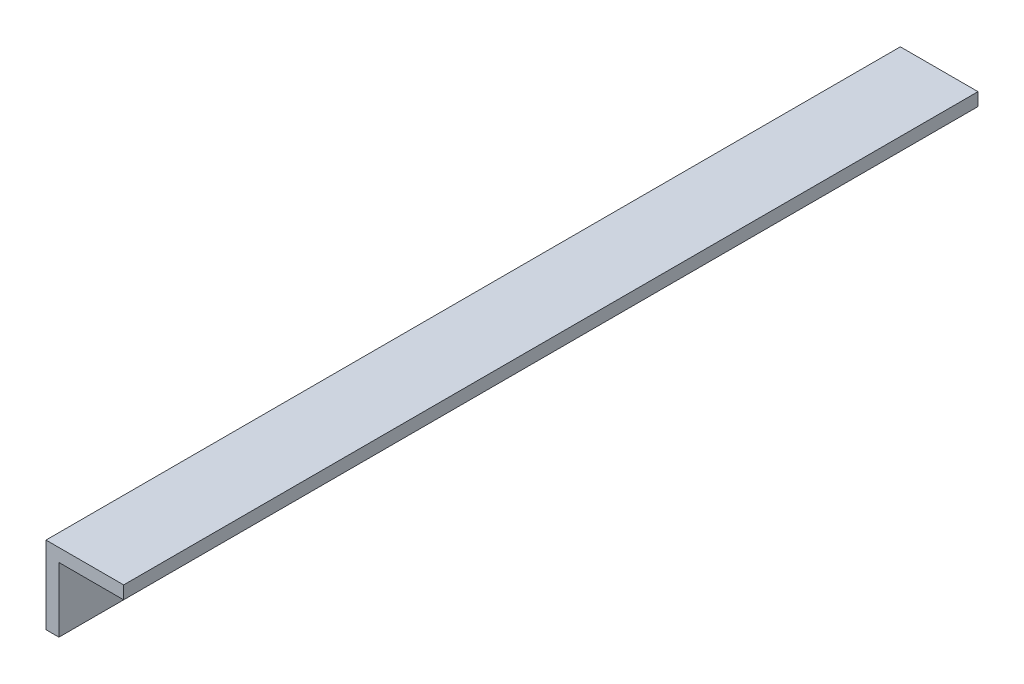
ISO-10303-21;
HEADER;
FILE_DESCRIPTION(('STEP AP214'),'2;1');
FILE_NAME('part.step','',(''),(''),'','','');
FILE_SCHEMA(('AUTOMOTIVE_DESIGN { 1 0 10303 214 1 1 1 1 }'));
ENDSEC;
DATA;
#1=APPLICATION_CONTEXT('core data for automotive mechanical design processes');
#2=APPLICATION_PROTOCOL_DEFINITION('international standard','automotive_design',2000,#1);
#3=PRODUCT_CONTEXT('',#1,'mechanical');
#4=PRODUCT('Part','Part','',(#3));
#5=PRODUCT_RELATED_PRODUCT_CATEGORY('part','',(#4));
#6=PRODUCT_DEFINITION_FORMATION('','',#4);
#7=PRODUCT_DEFINITION_CONTEXT('part definition',#1,'design');
#8=PRODUCT_DEFINITION('design','',#6,#7);
#9=PRODUCT_DEFINITION_SHAPE('','',#8);
#10=(LENGTH_UNIT() NAMED_UNIT(*) SI_UNIT(.MILLI.,.METRE.));
#11=(NAMED_UNIT(*) PLANE_ANGLE_UNIT() SI_UNIT($,.RADIAN.));
#12=(NAMED_UNIT(*) SI_UNIT($,.STERADIAN.) SOLID_ANGLE_UNIT());
#13=UNCERTAINTY_MEASURE_WITH_UNIT(LENGTH_MEASURE(1.E-05),#10,'distance_accuracy_value','');
#14=(GEOMETRIC_REPRESENTATION_CONTEXT(3) GLOBAL_UNCERTAINTY_ASSIGNED_CONTEXT((#13)) GLOBAL_UNIT_ASSIGNED_CONTEXT((#10,
#11,#12)) REPRESENTATION_CONTEXT('',''));
#15=CARTESIAN_POINT('',(0.,0.,0.));
#16=DIRECTION('',(0.,0.,1.));
#17=DIRECTION('',(1.,0.,0.));
#18=AXIS2_PLACEMENT_3D('',#15,#16,#17);
#19=CARTESIAN_POINT('',(269.875,946.3,269.781536726415));
#20=DIRECTION('',(1.,0.,0.));
#21=DIRECTION('',(0.,0.,1.));
#22=AXIS2_PLACEMENT_3D('',#19,#20,#21);
#23=PLANE('',#22);
#24=CARTESIAN_POINT('',(269.875,962.174999999998,71.808874461128));
#25=DIRECTION('',(-1.,0.,0.));
#26=DIRECTION('',(0.,0.,1.));
#27=AXIS2_PLACEMENT_3D('',#24,#25,#26);
#28=CIRCLE('',#27,6.34999999998303);
#29=CARTESIAN_POINT('',(269.875,962.174999999998,78.1588744611111));
#30=VERTEX_POINT('',#29);
#31=EDGE_CURVE('E253',#30,#30,#28,.T.);
#32=ORIENTED_EDGE('',*,*,#31,.F.);
#33=EDGE_LOOP('',(#32));
#34=FACE_BOUND('',#33,.T.);
#35=CARTESIAN_POINT('',(269.875,962.174999999998,109.908874461128));
#36=DIRECTION('',(-1.,0.,0.));
#37=DIRECTION('',(0.,0.,1.));
#38=AXIS2_PLACEMENT_3D('',#35,#36,#37);
#39=CIRCLE('',#38,6.34999999998316);
#40=CARTESIAN_POINT('',(269.875,962.174999999998,116.258874461111));
#41=VERTEX_POINT('',#40);
#42=EDGE_CURVE('E113',#41,#41,#39,.T.);
#43=ORIENTED_EDGE('',*,*,#42,.F.);
#44=EDGE_LOOP('',(#43));
#45=FACE_BOUND('',#44,.T.);
#46=DIRECTION('',(0.,0.,-1.));
#47=VECTOR('',#46,1.);
#48=CARTESIAN_POINT('',(269.875,984.4,269.781536726415));
#49=LINE('',#48,#47);
#50=CARTESIAN_POINT('',(269.875,984.4,215.9));
#51=VERTEX_POINT('',#50);
#52=CARTESIAN_POINT('',(269.875,984.4,-203.2));
#53=VERTEX_POINT('',#52);
#54=EDGE_CURVE('E141',#51,#53,#49,.T.);
#55=ORIENTED_EDGE('',*,*,#54,.T.);
#56=DIRECTION('',(0.,-1.,0.));
#57=VECTOR('',#56,1.);
#58=CARTESIAN_POINT('',(269.875,946.3,-203.2));
#59=LINE('',#58,#57);
#60=CARTESIAN_POINT('',(269.875,946.3,-203.2));
#61=VERTEX_POINT('',#60);
#62=EDGE_CURVE('E136',#53,#61,#59,.T.);
#63=ORIENTED_EDGE('',*,*,#62,.T.);
#64=DIRECTION('',(0.,0.,-1.));
#65=VECTOR('',#64,1.);
#66=CARTESIAN_POINT('',(269.875,946.3,269.781536726415));
#67=LINE('',#66,#65);
#68=CARTESIAN_POINT('',(269.875,946.3,215.9));
#69=VERTEX_POINT('',#68);
#70=EDGE_CURVE('E154',#69,#61,#67,.T.);
#71=ORIENTED_EDGE('',*,*,#70,.F.);
#72=DIRECTION('',(0.,-1.,0.));
#73=VECTOR('',#72,1.);
#74=CARTESIAN_POINT('',(269.875,946.3,215.9));
#75=LINE('',#74,#73);
#76=EDGE_CURVE('E43',#51,#69,#75,.T.);
#77=ORIENTED_EDGE('',*,*,#76,.F.);
#78=EDGE_LOOP('',(#55,#63,#71,#77));
#79=FACE_BOUND('',#78,.T.);
#80=ADVANCED_FACE('F39',(#34,#45,#79),#23,.F.);
#81=CARTESIAN_POINT('',(269.875,946.3,269.781536726415));
#82=DIRECTION('',(0.,-1.,0.));
#83=DIRECTION('',(0.,0.,-1.));
#84=AXIS2_PLACEMENT_3D('',#81,#82,#83);
#85=PLANE('',#84);
#86=DIRECTION('',(-1.,0.,0.));
#87=VECTOR('',#86,1.);
#88=CARTESIAN_POINT('',(269.875,946.3,215.9));
#89=LINE('',#88,#87);
#90=CARTESIAN_POINT('',(276.225,946.3,215.9));
#91=VERTEX_POINT('',#90);
#92=EDGE_CURVE('E143',#91,#69,#89,.T.);
#93=ORIENTED_EDGE('',*,*,#92,.T.);
#94=ORIENTED_EDGE('',*,*,#70,.T.);
#95=DIRECTION('',(-1.,0.,0.));
#96=VECTOR('',#95,1.);
#97=CARTESIAN_POINT('',(269.875,946.3,-203.2));
#98=LINE('',#97,#96);
#99=CARTESIAN_POINT('',(276.225,946.3,-203.2));
#100=VERTEX_POINT('',#99);
#101=EDGE_CURVE('E128',#100,#61,#98,.T.);
#102=ORIENTED_EDGE('',*,*,#101,.F.);
#103=DIRECTION('',(0.,0.,-1.));
#104=VECTOR('',#103,1.);
#105=CARTESIAN_POINT('',(276.225,946.3,269.781536726415));
#106=LINE('',#105,#104);
#107=EDGE_CURVE('E158',#91,#100,#106,.T.);
#108=ORIENTED_EDGE('',*,*,#107,.F.);
#109=EDGE_LOOP('',(#93,#94,#102,#108));
#110=FACE_BOUND('',#109,.T.);
#111=ADVANCED_FACE('F177',(#110),#85,.T.);
#112=CARTESIAN_POINT('',(276.225,946.3,269.781536726415));
#113=DIRECTION('',(1.,0.,0.));
#114=DIRECTION('',(0.,0.,1.));
#115=AXIS2_PLACEMENT_3D('',#112,#113,#114);
#116=PLANE('',#115);
#117=CARTESIAN_POINT('',(276.225,962.174999999998,71.808874461128));
#118=DIRECTION('',(-1.,0.,0.));
#119=DIRECTION('',(0.,0.,1.));
#120=AXIS2_PLACEMENT_3D('',#117,#118,#119);
#121=CIRCLE('',#120,6.34999999998303);
#122=CARTESIAN_POINT('',(276.225,962.174999999998,78.1588744611111));
#123=VERTEX_POINT('',#122);
#124=EDGE_CURVE('E256',#123,#123,#121,.T.);
#125=ORIENTED_EDGE('',*,*,#124,.T.);
#126=EDGE_LOOP('',(#125));
#127=FACE_BOUND('',#126,.T.);
#128=CARTESIAN_POINT('',(276.225,962.174999999998,109.908874461128));
#129=DIRECTION('',(-1.,0.,0.));
#130=DIRECTION('',(0.,0.,1.));
#131=AXIS2_PLACEMENT_3D('',#128,#129,#130);
#132=CIRCLE('',#131,6.34999999998316);
#133=CARTESIAN_POINT('',(276.225,962.174999999998,116.258874461111));
#134=VERTEX_POINT('',#133);
#135=EDGE_CURVE('E131',#134,#134,#132,.T.);
#136=ORIENTED_EDGE('',*,*,#135,.T.);
#137=EDGE_LOOP('',(#136));
#138=FACE_BOUND('',#137,.T.);
#139=DIRECTION('',(0.,-1.,0.));
#140=VECTOR('',#139,1.);
#141=CARTESIAN_POINT('',(276.225,946.3,215.9));
#142=LINE('',#141,#140);
#143=CARTESIAN_POINT('',(276.225,978.05,215.9));
#144=VERTEX_POINT('',#143);
#145=EDGE_CURVE('E146',#144,#91,#142,.T.);
#146=ORIENTED_EDGE('',*,*,#145,.T.);
#147=ORIENTED_EDGE('',*,*,#107,.T.);
#148=DIRECTION('',(0.,-1.,0.));
#149=VECTOR('',#148,1.);
#150=CARTESIAN_POINT('',(276.225,946.3,-203.2));
#151=LINE('',#150,#149);
#152=CARTESIAN_POINT('',(276.225,978.05,-203.2));
#153=VERTEX_POINT('',#152);
#154=EDGE_CURVE('E124',#153,#100,#151,.T.);
#155=ORIENTED_EDGE('',*,*,#154,.F.);
#156=DIRECTION('',(0.,0.,-1.));
#157=VECTOR('',#156,1.);
#158=CARTESIAN_POINT('',(276.225,978.05,269.781536726415));
#159=LINE('',#158,#157);
#160=EDGE_CURVE('E119',#144,#153,#159,.T.);
#161=ORIENTED_EDGE('',*,*,#160,.F.);
#162=EDGE_LOOP('',(#146,#147,#155,#161));
#163=FACE_BOUND('',#162,.T.);
#164=ADVANCED_FACE('F180',(#127,#138,#163),#116,.T.);
#165=CARTESIAN_POINT('',(269.875,978.05,269.781536726415));
#166=DIRECTION('',(0.,-1.,0.));
#167=DIRECTION('',(0.,0.,-1.));
#168=AXIS2_PLACEMENT_3D('',#165,#166,#167);
#169=PLANE('',#168);
#170=DIRECTION('',(-1.,0.,0.));
#171=VECTOR('',#170,1.);
#172=CARTESIAN_POINT('',(269.875,978.05,215.9));
#173=LINE('',#172,#171);
#174=CARTESIAN_POINT('',(307.975,978.05,215.9));
#175=VERTEX_POINT('',#174);
#176=EDGE_CURVE('E66',#175,#144,#173,.T.);
#177=ORIENTED_EDGE('',*,*,#176,.T.);
#178=ORIENTED_EDGE('',*,*,#160,.T.);
#179=DIRECTION('',(-1.,0.,0.));
#180=VECTOR('',#179,1.);
#181=CARTESIAN_POINT('',(269.875,978.05,-203.2));
#182=LINE('',#181,#180);
#183=CARTESIAN_POINT('',(307.975,978.05,-203.2));
#184=VERTEX_POINT('',#183);
#185=EDGE_CURVE('E108',#184,#153,#182,.T.);
#186=ORIENTED_EDGE('',*,*,#185,.F.);
#187=DIRECTION('',(0.,0.,-1.));
#188=VECTOR('',#187,1.);
#189=CARTESIAN_POINT('',(307.975,978.05,269.781536726415));
#190=LINE('',#189,#188);
#191=EDGE_CURVE('E115',#175,#184,#190,.T.);
#192=ORIENTED_EDGE('',*,*,#191,.F.);
#193=EDGE_LOOP('',(#177,#178,#186,#192));
#194=FACE_BOUND('',#193,.T.);
#195=ADVANCED_FACE('F121',(#194),#169,.T.);
#196=CARTESIAN_POINT('',(307.975,978.05,269.781536726415));
#197=DIRECTION('',(1.,0.,0.));
#198=DIRECTION('',(0.,0.,1.));
#199=AXIS2_PLACEMENT_3D('',#196,#197,#198);
#200=PLANE('',#199);
#201=DIRECTION('',(0.,-1.,0.));
#202=VECTOR('',#201,1.);
#203=CARTESIAN_POINT('',(307.975,978.05,215.9));
#204=LINE('',#203,#202);
#205=CARTESIAN_POINT('',(307.975,984.4,215.9));
#206=VERTEX_POINT('',#205);
#207=EDGE_CURVE('E49',#206,#175,#204,.T.);
#208=ORIENTED_EDGE('',*,*,#207,.T.);
#209=ORIENTED_EDGE('',*,*,#191,.T.);
#210=DIRECTION('',(0.,-1.,0.));
#211=VECTOR('',#210,1.);
#212=CARTESIAN_POINT('',(307.975,978.05,-203.2));
#213=LINE('',#212,#211);
#214=CARTESIAN_POINT('',(307.975,984.4,-203.2));
#215=VERTEX_POINT('',#214);
#216=EDGE_CURVE('E105',#215,#184,#213,.T.);
#217=ORIENTED_EDGE('',*,*,#216,.F.);
#218=DIRECTION('',(0.,0.,-1.));
#219=VECTOR('',#218,1.);
#220=CARTESIAN_POINT('',(307.975,984.4,269.781536726415));
#221=LINE('',#220,#219);
#222=EDGE_CURVE('E118',#206,#215,#221,.T.);
#223=ORIENTED_EDGE('',*,*,#222,.F.);
#224=EDGE_LOOP('',(#208,#209,#217,#223));
#225=FACE_BOUND('',#224,.T.);
#226=ADVANCED_FACE('F116',(#225),#200,.T.);
#227=CARTESIAN_POINT('',(269.875,984.4,269.781536726415));
#228=DIRECTION('',(0.,-1.,0.));
#229=DIRECTION('',(0.,0.,-1.));
#230=AXIS2_PLACEMENT_3D('',#227,#228,#229);
#231=PLANE('',#230);
#232=ORIENTED_EDGE('',*,*,#222,.T.);
#233=DIRECTION('',(-1.,0.,0.));
#234=VECTOR('',#233,1.);
#235=CARTESIAN_POINT('',(269.875,984.4,-203.2));
#236=LINE('',#235,#234);
#237=EDGE_CURVE('E110',#215,#53,#236,.T.);
#238=ORIENTED_EDGE('',*,*,#237,.T.);
#239=ORIENTED_EDGE('',*,*,#54,.F.);
#240=DIRECTION('',(-1.,0.,0.));
#241=VECTOR('',#240,1.);
#242=CARTESIAN_POINT('',(269.875,984.4,215.9));
#243=LINE('',#242,#241);
#244=EDGE_CURVE('E11',#206,#51,#243,.T.);
#245=ORIENTED_EDGE('',*,*,#244,.F.);
#246=EDGE_LOOP('',(#232,#238,#239,#245));
#247=FACE_BOUND('',#246,.T.);
#248=ADVANCED_FACE('F41',(#247),#231,.F.);
#249=CARTESIAN_POINT('',(269.875,190.65,215.9));
#250=DIRECTION('',(0.,0.,-1.));
#251=DIRECTION('',(0.,1.,0.));
#252=AXIS2_PLACEMENT_3D('',#249,#250,#251);
#253=PLANE('',#252);
#254=ORIENTED_EDGE('',*,*,#207,.F.);
#255=ORIENTED_EDGE('',*,*,#244,.T.);
#256=ORIENTED_EDGE('',*,*,#76,.T.);
#257=ORIENTED_EDGE('',*,*,#92,.F.);
#258=ORIENTED_EDGE('',*,*,#145,.F.);
#259=ORIENTED_EDGE('',*,*,#176,.F.);
#260=EDGE_LOOP('',(#254,#255,#256,#257,#258,#259));
#261=FACE_BOUND('',#260,.T.);
#262=ADVANCED_FACE('F171',(#261),#253,.F.);
#263=CARTESIAN_POINT('',(269.875,190.65,-203.2));
#264=DIRECTION('',(0.,0.,1.));
#265=DIRECTION('',(0.,-1.,0.));
#266=AXIS2_PLACEMENT_3D('',#263,#264,#265);
#267=PLANE('',#266);
#268=ORIENTED_EDGE('',*,*,#237,.F.);
#269=ORIENTED_EDGE('',*,*,#216,.T.);
#270=ORIENTED_EDGE('',*,*,#185,.T.);
#271=ORIENTED_EDGE('',*,*,#154,.T.);
#272=ORIENTED_EDGE('',*,*,#101,.T.);
#273=ORIENTED_EDGE('',*,*,#62,.F.);
#274=EDGE_LOOP('',(#268,#269,#270,#271,#272,#273));
#275=FACE_BOUND('',#274,.T.);
#276=ADVANCED_FACE('F106',(#275),#267,.F.);
#277=CARTESIAN_POINT('',(269.875,962.174999999998,109.908874461128));
#278=DIRECTION('',(1.,0.,0.));
#279=DIRECTION('',(0.,0.,1.));
#280=AXIS2_PLACEMENT_3D('',#277,#278,#279);
#281=CYLINDRICAL_SURFACE('',#280,6.34999999998316);
#282=CARTESIAN_POINT('',(269.875,962.174999999998,116.258874461111));
#283=CARTESIAN_POINT('',(269.941145833333,962.174999999998,116.258874461111));
#284=CARTESIAN_POINT('',(270.007291666667,962.174999999998,116.258874461111));
#285=CARTESIAN_POINT('',(270.139583333333,962.174999999998,116.258874461111));
#286=CARTESIAN_POINT('',(270.205729166667,962.174999999998,116.258874461111));
#287=CARTESIAN_POINT('',(270.338020833333,962.174999999998,116.258874461111));
#288=CARTESIAN_POINT('',(270.404166666667,962.174999999998,116.258874461111));
#289=CARTESIAN_POINT('',(270.536458333333,962.174999999998,116.258874461111));
#290=CARTESIAN_POINT('',(270.602604166667,962.174999999998,116.258874461111));
#291=CARTESIAN_POINT('',(270.734895833333,962.174999999998,116.258874461111));
#292=CARTESIAN_POINT('',(270.801041666667,962.174999999998,116.258874461111));
#293=CARTESIAN_POINT('',(270.933333333333,962.174999999998,116.258874461111));
#294=CARTESIAN_POINT('',(270.999479166667,962.174999999998,116.258874461111));
#295=CARTESIAN_POINT('',(271.131770833333,962.174999999998,116.258874461111));
#296=CARTESIAN_POINT('',(271.197916666667,962.174999999998,116.258874461111));
#297=CARTESIAN_POINT('',(271.330208333333,962.174999999998,116.258874461111));
#298=CARTESIAN_POINT('',(271.396354166667,962.174999999998,116.258874461111));
#299=CARTESIAN_POINT('',(271.528645833333,962.174999999998,116.258874461111));
#300=CARTESIAN_POINT('',(271.594791666667,962.174999999998,116.258874461111));
#301=CARTESIAN_POINT('',(271.727083333333,962.174999999998,116.258874461111));
#302=CARTESIAN_POINT('',(271.793229166667,962.174999999998,116.258874461111));
#303=CARTESIAN_POINT('',(271.925520833333,962.174999999998,116.258874461111));
#304=CARTESIAN_POINT('',(271.991666666667,962.174999999998,116.258874461111));
#305=CARTESIAN_POINT('',(272.123958333333,962.174999999998,116.258874461111));
#306=CARTESIAN_POINT('',(272.190104166667,962.174999999998,116.258874461111));
#307=CARTESIAN_POINT('',(272.322395833333,962.174999999998,116.258874461111));
#308=CARTESIAN_POINT('',(272.388541666667,962.174999999998,116.258874461111));
#309=CARTESIAN_POINT('',(272.520833333333,962.174999999998,116.258874461111));
#310=CARTESIAN_POINT('',(272.586979166667,962.174999999998,116.258874461111));
#311=CARTESIAN_POINT('',(272.719270833333,962.174999999998,116.258874461111));
#312=CARTESIAN_POINT('',(272.785416666667,962.174999999998,116.258874461111));
#313=CARTESIAN_POINT('',(272.917708333333,962.174999999998,116.258874461111));
#314=CARTESIAN_POINT('',(272.983854166667,962.174999999998,116.258874461111));
#315=CARTESIAN_POINT('',(273.116145833333,962.174999999998,116.258874461111));
#316=CARTESIAN_POINT('',(273.182291666667,962.174999999998,116.258874461111));
#317=CARTESIAN_POINT('',(273.314583333333,962.174999999998,116.258874461111));
#318=CARTESIAN_POINT('',(273.380729166667,962.174999999998,116.258874461111));
#319=CARTESIAN_POINT('',(273.513020833333,962.174999999998,116.258874461111));
#320=CARTESIAN_POINT('',(273.579166666667,962.174999999998,116.258874461111));
#321=CARTESIAN_POINT('',(273.711458333333,962.174999999998,116.258874461111));
#322=CARTESIAN_POINT('',(273.777604166667,962.174999999998,116.258874461111));
#323=CARTESIAN_POINT('',(273.909895833333,962.174999999998,116.258874461111));
#324=CARTESIAN_POINT('',(273.976041666667,962.174999999998,116.258874461111));
#325=CARTESIAN_POINT('',(274.108333333333,962.174999999998,116.258874461111));
#326=CARTESIAN_POINT('',(274.174479166667,962.174999999998,116.258874461111));
#327=CARTESIAN_POINT('',(274.306770833333,962.174999999998,116.258874461111));
#328=CARTESIAN_POINT('',(274.372916666667,962.174999999998,116.258874461111));
#329=CARTESIAN_POINT('',(274.505208333333,962.174999999998,116.258874461111));
#330=CARTESIAN_POINT('',(274.571354166667,962.174999999998,116.258874461111));
#331=CARTESIAN_POINT('',(274.703645833333,962.174999999998,116.258874461111));
#332=CARTESIAN_POINT('',(274.769791666667,962.174999999998,116.258874461111));
#333=CARTESIAN_POINT('',(274.902083333333,962.174999999998,116.258874461111));
#334=CARTESIAN_POINT('',(274.968229166667,962.174999999998,116.258874461111));
#335=CARTESIAN_POINT('',(275.100520833333,962.174999999998,116.258874461111));
#336=CARTESIAN_POINT('',(275.166666666667,962.174999999998,116.258874461111));
#337=CARTESIAN_POINT('',(275.298958333333,962.174999999998,116.258874461111));
#338=CARTESIAN_POINT('',(275.365104166667,962.174999999998,116.258874461111));
#339=CARTESIAN_POINT('',(275.497395833333,962.174999999998,116.258874461111));
#340=CARTESIAN_POINT('',(275.563541666667,962.174999999998,116.258874461111));
#341=CARTESIAN_POINT('',(275.695833333333,962.174999999998,116.258874461111));
#342=CARTESIAN_POINT('',(275.761979166667,962.174999999998,116.258874461111));
#343=CARTESIAN_POINT('',(275.894270833333,962.174999999998,116.258874461111));
#344=CARTESIAN_POINT('',(275.960416666667,962.174999999998,116.258874461111));
#345=CARTESIAN_POINT('',(276.092708333333,962.174999999998,116.258874461111));
#346=CARTESIAN_POINT('',(276.158854166667,962.174999999998,116.258874461111));
#347=CARTESIAN_POINT('',(276.225,962.174999999998,116.258874461111));
#348=B_SPLINE_CURVE_WITH_KNOTS('',3,(#282,#283,#284,#285,#286,#287,#288,#289,#290,#291,#292,
#293,#294,#295,#296,#297,#298,#299,#300,#301,#302,#303,#304,#305,#306,#307,#308,#309,#310,#311,
#312,#313,#314,#315,#316,#317,#318,#319,#320,#321,#322,#323,#324,#325,#326,#327,#328,#329,#330,
#331,#332,#333,#334,#335,#336,#337,#338,#339,#340,#341,#342,#343,#344,#345,#346,#347),
.UNSPECIFIED.,.F.,.F.,(4,2,2,2,2,2,2,2,2,2,2,2,2,2,2,2,2,2,2,2,2,2,2,2,2,2,2,2,2,2,2,2,4),(0.,
0.198437500000037,0.396875000000019,0.595312500000056,0.793750000000037,0.992187500000019,
1.19062500000006,1.38906250000004,1.58750000000002,1.78593750000006,1.98437500000004,
2.18281250000002,2.38125000000006,2.57968750000004,2.77812500000002,2.97656250000006,
3.17500000000004,3.37343750000002,3.57187500000006,3.77031250000004,3.96875000000002,
4.16718750000006,4.36562500000004,4.56406250000002,4.76250000000006,4.96093750000004,
5.15937500000002,5.35781250000006,5.55625000000004,5.75468750000002,5.95312500000006,
6.15156250000004,6.35000000000002),.UNSPECIFIED.);
#349=EDGE_CURVE('BSEAM229',#41,#134,#348,.T.);
#350=ORIENTED_EDGE('',*,*,#42,.T.);
#351=ORIENTED_EDGE('',*,*,#135,.F.);
#352=ORIENTED_EDGE('',*,*,#349,.T.);
#353=ORIENTED_EDGE('',*,*,#349,.F.);
#354=EDGE_LOOP('',(#350,#352,#351,#353));
#355=FACE_BOUND('',#354,.T.);
#356=ADVANCED_FACE('F229',(#355),#281,.F.);
#357=CARTESIAN_POINT('',(269.875,962.174999999998,71.808874461128));
#358=DIRECTION('',(1.,0.,0.));
#359=DIRECTION('',(0.,0.,1.));
#360=AXIS2_PLACEMENT_3D('',#357,#358,#359);
#361=CYLINDRICAL_SURFACE('',#360,6.34999999998303);
#362=CARTESIAN_POINT('',(269.875,962.174999999998,78.1588744611111));
#363=CARTESIAN_POINT('',(269.941145833333,962.174999999998,78.1588744611111));
#364=CARTESIAN_POINT('',(270.007291666667,962.174999999998,78.1588744611111));
#365=CARTESIAN_POINT('',(270.139583333333,962.174999999998,78.1588744611111));
#366=CARTESIAN_POINT('',(270.205729166667,962.174999999998,78.1588744611111));
#367=CARTESIAN_POINT('',(270.338020833333,962.174999999998,78.1588744611111));
#368=CARTESIAN_POINT('',(270.404166666667,962.174999999998,78.1588744611111));
#369=CARTESIAN_POINT('',(270.536458333333,962.174999999998,78.1588744611111));
#370=CARTESIAN_POINT('',(270.602604166667,962.174999999998,78.1588744611111));
#371=CARTESIAN_POINT('',(270.734895833333,962.174999999998,78.1588744611111));
#372=CARTESIAN_POINT('',(270.801041666667,962.174999999998,78.1588744611111));
#373=CARTESIAN_POINT('',(270.933333333333,962.174999999998,78.1588744611111));
#374=CARTESIAN_POINT('',(270.999479166667,962.174999999998,78.1588744611111));
#375=CARTESIAN_POINT('',(271.131770833333,962.174999999998,78.1588744611111));
#376=CARTESIAN_POINT('',(271.197916666667,962.174999999998,78.1588744611111));
#377=CARTESIAN_POINT('',(271.330208333333,962.174999999998,78.1588744611111));
#378=CARTESIAN_POINT('',(271.396354166667,962.174999999998,78.1588744611111));
#379=CARTESIAN_POINT('',(271.528645833333,962.174999999998,78.1588744611111));
#380=CARTESIAN_POINT('',(271.594791666667,962.174999999998,78.1588744611111));
#381=CARTESIAN_POINT('',(271.727083333333,962.174999999998,78.1588744611111));
#382=CARTESIAN_POINT('',(271.793229166667,962.174999999998,78.1588744611111));
#383=CARTESIAN_POINT('',(271.925520833333,962.174999999998,78.1588744611111));
#384=CARTESIAN_POINT('',(271.991666666667,962.174999999998,78.1588744611111));
#385=CARTESIAN_POINT('',(272.123958333333,962.174999999998,78.1588744611111));
#386=CARTESIAN_POINT('',(272.190104166667,962.174999999998,78.1588744611111));
#387=CARTESIAN_POINT('',(272.322395833333,962.174999999998,78.1588744611111));
#388=CARTESIAN_POINT('',(272.388541666667,962.174999999998,78.1588744611111));
#389=CARTESIAN_POINT('',(272.520833333333,962.174999999998,78.1588744611111));
#390=CARTESIAN_POINT('',(272.586979166667,962.174999999998,78.1588744611111));
#391=CARTESIAN_POINT('',(272.719270833333,962.174999999998,78.1588744611111));
#392=CARTESIAN_POINT('',(272.785416666667,962.174999999998,78.1588744611111));
#393=CARTESIAN_POINT('',(272.917708333333,962.174999999998,78.1588744611111));
#394=CARTESIAN_POINT('',(272.983854166667,962.174999999998,78.1588744611111));
#395=CARTESIAN_POINT('',(273.116145833333,962.174999999998,78.1588744611111));
#396=CARTESIAN_POINT('',(273.182291666667,962.174999999998,78.1588744611111));
#397=CARTESIAN_POINT('',(273.314583333333,962.174999999998,78.1588744611111));
#398=CARTESIAN_POINT('',(273.380729166667,962.174999999998,78.1588744611111));
#399=CARTESIAN_POINT('',(273.513020833333,962.174999999998,78.1588744611111));
#400=CARTESIAN_POINT('',(273.579166666667,962.174999999998,78.1588744611111));
#401=CARTESIAN_POINT('',(273.711458333333,962.174999999998,78.1588744611111));
#402=CARTESIAN_POINT('',(273.777604166667,962.174999999998,78.1588744611111));
#403=CARTESIAN_POINT('',(273.909895833333,962.174999999998,78.1588744611111));
#404=CARTESIAN_POINT('',(273.976041666667,962.174999999998,78.1588744611111));
#405=CARTESIAN_POINT('',(274.108333333333,962.174999999998,78.1588744611111));
#406=CARTESIAN_POINT('',(274.174479166667,962.174999999998,78.1588744611111));
#407=CARTESIAN_POINT('',(274.306770833333,962.174999999998,78.1588744611111));
#408=CARTESIAN_POINT('',(274.372916666667,962.174999999998,78.1588744611111));
#409=CARTESIAN_POINT('',(274.505208333333,962.174999999998,78.1588744611111));
#410=CARTESIAN_POINT('',(274.571354166667,962.174999999998,78.1588744611111));
#411=CARTESIAN_POINT('',(274.703645833333,962.174999999998,78.1588744611111));
#412=CARTESIAN_POINT('',(274.769791666667,962.174999999998,78.1588744611111));
#413=CARTESIAN_POINT('',(274.902083333333,962.174999999998,78.1588744611111));
#414=CARTESIAN_POINT('',(274.968229166667,962.174999999998,78.1588744611111));
#415=CARTESIAN_POINT('',(275.100520833333,962.174999999998,78.1588744611111));
#416=CARTESIAN_POINT('',(275.166666666667,962.174999999998,78.1588744611111));
#417=CARTESIAN_POINT('',(275.298958333333,962.174999999998,78.1588744611111));
#418=CARTESIAN_POINT('',(275.365104166667,962.174999999998,78.1588744611111));
#419=CARTESIAN_POINT('',(275.497395833333,962.174999999998,78.1588744611111));
#420=CARTESIAN_POINT('',(275.563541666667,962.174999999998,78.1588744611111));
#421=CARTESIAN_POINT('',(275.695833333333,962.174999999998,78.1588744611111));
#422=CARTESIAN_POINT('',(275.761979166667,962.174999999998,78.1588744611111));
#423=CARTESIAN_POINT('',(275.894270833333,962.174999999998,78.1588744611111));
#424=CARTESIAN_POINT('',(275.960416666667,962.174999999998,78.1588744611111));
#425=CARTESIAN_POINT('',(276.092708333333,962.174999999998,78.1588744611111));
#426=CARTESIAN_POINT('',(276.158854166667,962.174999999998,78.1588744611111));
#427=CARTESIAN_POINT('',(276.225,962.174999999998,78.1588744611111));
#428=B_SPLINE_CURVE_WITH_KNOTS('',3,(#362,#363,#364,#365,#366,#367,#368,#369,#370,#371,#372,
#373,#374,#375,#376,#377,#378,#379,#380,#381,#382,#383,#384,#385,#386,#387,#388,#389,#390,#391,
#392,#393,#394,#395,#396,#397,#398,#399,#400,#401,#402,#403,#404,#405,#406,#407,#408,#409,#410,
#411,#412,#413,#414,#415,#416,#417,#418,#419,#420,#421,#422,#423,#424,#425,#426,#427),
.UNSPECIFIED.,.F.,.F.,(4,2,2,2,2,2,2,2,2,2,2,2,2,2,2,2,2,2,2,2,2,2,2,2,2,2,2,2,2,2,2,2,4),(0.,
0.198437500000037,0.396875000000019,0.595312500000056,0.793750000000037,0.992187500000019,
1.19062500000006,1.38906250000004,1.58750000000002,1.78593750000006,1.98437500000004,
2.18281250000002,2.38125000000006,2.57968750000004,2.77812500000002,2.97656250000006,
3.17500000000004,3.37343750000002,3.57187500000006,3.77031250000004,3.96875000000002,
4.16718750000006,4.36562500000004,4.56406250000002,4.76250000000006,4.96093750000004,
5.15937500000002,5.35781250000006,5.55625000000004,5.75468750000002,5.95312500000006,
6.15156250000004,6.35000000000002),.UNSPECIFIED.);
#429=EDGE_CURVE('BSEAM237',#30,#123,#428,.T.);
#430=ORIENTED_EDGE('',*,*,#31,.T.);
#431=ORIENTED_EDGE('',*,*,#124,.F.);
#432=ORIENTED_EDGE('',*,*,#429,.T.);
#433=ORIENTED_EDGE('',*,*,#429,.F.);
#434=EDGE_LOOP('',(#430,#432,#431,#433));
#435=FACE_BOUND('',#434,.T.);
#436=ADVANCED_FACE('F237',(#435),#361,.F.);
#437=CLOSED_SHELL('',(#80,#111,#164,#195,#226,#248,#262,#276,#356,#436));
#438=MANIFOLD_SOLID_BREP('B2',#437);
#439=ADVANCED_BREP_SHAPE_REPRESENTATION('',(#18,#438),#14);
#440=SHAPE_DEFINITION_REPRESENTATION(#9,#439);
ENDSEC;
END-ISO-10303-21;
